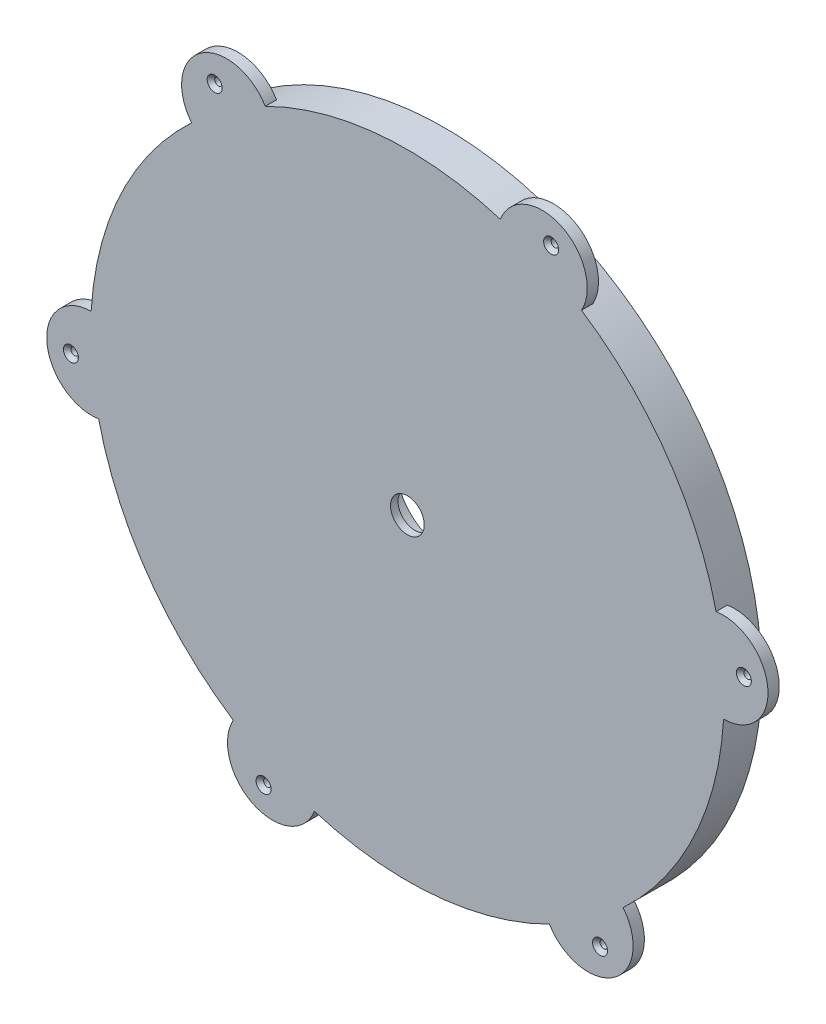
ISO-10303-21;
HEADER;
FILE_DESCRIPTION(('STEP AP214'),'2;1');
FILE_NAME('part.step','',(''),(''),'','','');
FILE_SCHEMA(('AUTOMOTIVE_DESIGN { 1 0 10303 214 1 1 1 1 }'));
ENDSEC;
DATA;
#1=APPLICATION_CONTEXT('core data for automotive mechanical design processes');
#2=APPLICATION_PROTOCOL_DEFINITION('international standard','automotive_design',2000,#1);
#3=PRODUCT_CONTEXT('',#1,'mechanical');
#4=PRODUCT('Part','Part','',(#3));
#5=PRODUCT_RELATED_PRODUCT_CATEGORY('part','',(#4));
#6=PRODUCT_DEFINITION_FORMATION('','',#4);
#7=PRODUCT_DEFINITION_CONTEXT('part definition',#1,'design');
#8=PRODUCT_DEFINITION('design','',#6,#7);
#9=PRODUCT_DEFINITION_SHAPE('','',#8);
#10=(LENGTH_UNIT() NAMED_UNIT(*) SI_UNIT(.MILLI.,.METRE.));
#11=(NAMED_UNIT(*) PLANE_ANGLE_UNIT() SI_UNIT($,.RADIAN.));
#12=(NAMED_UNIT(*) SI_UNIT($,.STERADIAN.) SOLID_ANGLE_UNIT());
#13=UNCERTAINTY_MEASURE_WITH_UNIT(LENGTH_MEASURE(1.E-05),#10,'distance_accuracy_value','');
#14=(GEOMETRIC_REPRESENTATION_CONTEXT(3) GLOBAL_UNCERTAINTY_ASSIGNED_CONTEXT((#13)) GLOBAL_UNIT_ASSIGNED_CONTEXT((#10,
#11,#12)) REPRESENTATION_CONTEXT('',''));
#15=CARTESIAN_POINT('',(0.,0.,0.));
#16=DIRECTION('',(0.,0.,1.));
#17=DIRECTION('',(1.,0.,0.));
#18=AXIS2_PLACEMENT_3D('',#15,#16,#17);
#19=CARTESIAN_POINT('',(0.,0.,10.));
#20=DIRECTION('',(0.,0.,1.));
#21=DIRECTION('',(1.,0.,0.));
#22=AXIS2_PLACEMENT_3D('',#19,#20,#21);
#23=PLANE('',#22);
#24=CARTESIAN_POINT('',(38.3585910993566,81.4980832233902,10.));
#25=DIRECTION('',(0.,0.,1.));
#26=DIRECTION('',(1.,0.,0.));
#27=AXIS2_PLACEMENT_3D('',#24,#25,#26);
#28=CIRCLE('',#27,2.);
#29=CARTESIAN_POINT('',(40.3585910993566,81.4980832233902,10.));
#30=VERTEX_POINT('',#29);
#31=EDGE_CURVE('E305',#30,#30,#28,.T.);
#32=ORIENTED_EDGE('',*,*,#31,.F.);
#33=EDGE_LOOP('',(#32));
#34=FACE_BOUND('',#33,.T.);
#35=CARTESIAN_POINT('',(-51.4001148815162,73.9685559571175,10.));
#36=DIRECTION('',(0.,0.,1.));
#37=DIRECTION('',(1.,0.,0.));
#38=AXIS2_PLACEMENT_3D('',#35,#36,#37);
#39=CIRCLE('',#38,2.);
#40=CARTESIAN_POINT('',(-49.4001148815162,73.9685559571175,10.));
#41=VERTEX_POINT('',#40);
#42=EDGE_CURVE('E226',#41,#41,#39,.T.);
#43=ORIENTED_EDGE('',*,*,#42,.F.);
#44=EDGE_LOOP('',(#43));
#45=FACE_BOUND('',#44,.T.);
#46=CARTESIAN_POINT('',(-89.7587059808725,-7.52952726627367,10.));
#47=DIRECTION('',(0.,0.,1.));
#48=DIRECTION('',(1.,0.,0.));
#49=AXIS2_PLACEMENT_3D('',#46,#47,#48);
#50=CIRCLE('',#49,2.);
#51=CARTESIAN_POINT('',(-87.7587059808725,-7.52952726627367,10.));
#52=VERTEX_POINT('',#51);
#53=EDGE_CURVE('E219',#52,#52,#50,.T.);
#54=ORIENTED_EDGE('',*,*,#53,.F.);
#55=EDGE_LOOP('',(#54));
#56=FACE_BOUND('',#55,.T.);
#57=CARTESIAN_POINT('',(-38.3585910993561,-81.4980832233905,10.));
#58=DIRECTION('',(0.,0.,1.));
#59=DIRECTION('',(1.,0.,0.));
#60=AXIS2_PLACEMENT_3D('',#57,#58,#59);
#61=CIRCLE('',#60,2.);
#62=CARTESIAN_POINT('',(-36.3585910993561,-81.4980832233905,10.));
#63=VERTEX_POINT('',#62);
#64=EDGE_CURVE('E215',#63,#63,#61,.T.);
#65=ORIENTED_EDGE('',*,*,#64,.F.);
#66=EDGE_LOOP('',(#65));
#67=FACE_BOUND('',#66,.T.);
#68=CARTESIAN_POINT('',(51.4001148815167,-73.9685559571171,10.));
#69=DIRECTION('',(0.,0.,1.));
#70=DIRECTION('',(1.,0.,0.));
#71=AXIS2_PLACEMENT_3D('',#68,#69,#70);
#72=CIRCLE('',#71,2.);
#73=CARTESIAN_POINT('',(53.4001148815167,-73.9685559571171,10.));
#74=VERTEX_POINT('',#73);
#75=EDGE_CURVE('E211',#74,#74,#72,.T.);
#76=ORIENTED_EDGE('',*,*,#75,.F.);
#77=EDGE_LOOP('',(#76));
#78=FACE_BOUND('',#77,.T.);
#79=CARTESIAN_POINT('',(89.7587059808725,7.52952726627367,10.));
#80=DIRECTION('',(0.,0.,1.));
#81=DIRECTION('',(1.,0.,0.));
#82=AXIS2_PLACEMENT_3D('',#79,#80,#81);
#83=CIRCLE('',#82,2.);
#84=CARTESIAN_POINT('',(91.7587059808725,7.52952726627367,10.));
#85=VERTEX_POINT('',#84);
#86=EDGE_CURVE('E206',#85,#85,#83,.T.);
#87=ORIENTED_EDGE('',*,*,#86,.F.);
#88=EDGE_LOOP('',(#87));
#89=FACE_BOUND('',#88,.T.);
#90=CARTESIAN_POINT('',(0.,0.,10.));
#91=DIRECTION('',(0.,0.,1.));
#92=DIRECTION('',(1.,0.,0.));
#93=AXIS2_PLACEMENT_3D('',#90,#91,#92);
#94=CIRCLE('',#93,84.5);
#95=CARTESIAN_POINT('',(82.3545809556168,18.9201743021773,10.));
#96=VERTEX_POINT('',#95);
#97=CARTESIAN_POINT('',(46.4521042160023,70.5864860572168,10.));
#98=VERTEX_POINT('',#97);
#99=EDGE_CURVE('E134',#96,#98,#94,.T.);
#100=ORIENTED_EDGE('',*,*,#99,.T.);
#101=CARTESIAN_POINT('',(35.9848816025201,76.4548121183527,10.));
#102=DIRECTION('',(0.,0.,1.));
#103=DIRECTION('',(0.50000000000001,0.866025403784433,0.));
#104=AXIS2_PLACEMENT_3D('',#101,#102,#103);
#105=CIRCLE('',#104,12.);
#106=CARTESIAN_POINT('',(24.7919388880943,80.7812463766746,10.));
#107=VERTEX_POINT('',#106);
#108=EDGE_CURVE('E50',#98,#107,#105,.T.);
#109=ORIENTED_EDGE('',*,*,#108,.T.);
#110=CARTESIAN_POINT('',(-37.9036379814249,75.5219453389085,10.));
#111=VERTEX_POINT('',#110);
#112=EDGE_CURVE('E141',#107,#111,#94,.T.);
#113=ORIENTED_EDGE('',*,*,#112,.T.);
#114=CARTESIAN_POINT('',(-48.2193687347999,69.3912276791339,10.));
#115=DIRECTION('',(0.,0.,1.));
#116=DIRECTION('',(-0.499999999999992,0.866025403784443,0.));
#117=AXIS2_PLACEMENT_3D('',#114,#115,#116);
#118=CIRCLE('',#117,12.);
#119=CARTESIAN_POINT('',(-57.5626420675229,61.8610720744981,10.));
#120=VERTEX_POINT('',#119);
#121=EDGE_CURVE('E56',#111,#120,#118,.T.);
#122=ORIENTED_EDGE('',*,*,#121,.T.);
#123=CARTESIAN_POINT('',(-84.3557421974271,4.93545928169082,10.));
#124=VERTEX_POINT('',#123);
#125=EDGE_CURVE('E146',#120,#124,#94,.T.);
#126=ORIENTED_EDGE('',*,*,#125,.T.);
#127=CARTESIAN_POINT('',(-84.2042503373198,-7.06358443921965,10.));
#128=DIRECTION('',(0.,0.,1.));
#129=DIRECTION('',(-1.,0.,0.));
#130=AXIS2_PLACEMENT_3D('',#127,#128,#129);
#131=CIRCLE('',#130,12.);
#132=CARTESIAN_POINT('',(-82.3545809556168,-18.9201743021773,10.));
#133=VERTEX_POINT('',#132);
#134=EDGE_CURVE('E252',#124,#133,#131,.T.);
#135=ORIENTED_EDGE('',*,*,#134,.T.);
#136=CARTESIAN_POINT('',(-46.4521042160018,-70.5864860572171,10.));
#137=VERTEX_POINT('',#136);
#138=EDGE_CURVE('E152',#133,#137,#94,.T.);
#139=ORIENTED_EDGE('',*,*,#138,.T.);
#140=CARTESIAN_POINT('',(-35.9848816025196,-76.454812118353,10.));
#141=DIRECTION('',(0.,0.,1.));
#142=DIRECTION('',(-0.500000000000004,-0.866025403784436,0.));
#143=AXIS2_PLACEMENT_3D('',#140,#141,#142);
#144=CIRCLE('',#143,12.);
#145=CARTESIAN_POINT('',(-24.7919388880937,-80.7812463766748,10.));
#146=VERTEX_POINT('',#145);
#147=EDGE_CURVE('E257',#137,#146,#144,.T.);
#148=ORIENTED_EDGE('',*,*,#147,.T.);
#149=CARTESIAN_POINT('',(37.9036379814254,-75.5219453389083,10.));
#150=VERTEX_POINT('',#149);
#151=EDGE_CURVE('E149',#146,#150,#94,.T.);
#152=ORIENTED_EDGE('',*,*,#151,.T.);
#153=CARTESIAN_POINT('',(48.2193687348004,-69.3912276791336,10.));
#154=DIRECTION('',(0.,0.,1.));
#155=DIRECTION('',(0.499999999999998,-0.86602540378444,0.));
#156=AXIS2_PLACEMENT_3D('',#153,#154,#155);
#157=CIRCLE('',#156,12.);
#158=CARTESIAN_POINT('',(57.5626420675233,-61.8610720744977,10.));
#159=VERTEX_POINT('',#158);
#160=EDGE_CURVE('E262',#150,#159,#157,.T.);
#161=ORIENTED_EDGE('',*,*,#160,.T.);
#162=CARTESIAN_POINT('',(84.3557421974271,-4.93545928169082,10.));
#163=VERTEX_POINT('',#162);
#164=EDGE_CURVE('E143',#159,#163,#94,.T.);
#165=ORIENTED_EDGE('',*,*,#164,.T.);
#166=CARTESIAN_POINT('',(84.2042503373198,7.06358443921965,10.));
#167=DIRECTION('',(0.,0.,1.));
#168=DIRECTION('',(1.,0.,0.));
#169=AXIS2_PLACEMENT_3D('',#166,#167,#168);
#170=CIRCLE('',#169,12.);
#171=EDGE_CURVE('E138',#163,#96,#170,.T.);
#172=ORIENTED_EDGE('',*,*,#171,.T.);
#173=EDGE_LOOP('',(#100,#109,#113,#122,#126,#135,#139,#148,#152,#161,#165,#172));
#174=FACE_BOUND('',#173,.T.);
#175=CARTESIAN_POINT('',(0.,0.,10.));
#176=DIRECTION('',(0.,0.,1.));
#177=DIRECTION('',(1.,0.,0.));
#178=AXIS2_PLACEMENT_3D('',#175,#176,#177);
#179=CIRCLE('',#178,4.5);
#180=CARTESIAN_POINT('',(4.5,0.,10.));
#181=VERTEX_POINT('',#180);
#182=EDGE_CURVE('E154',#181,#181,#179,.T.);
#183=ORIENTED_EDGE('',*,*,#182,.F.);
#184=EDGE_LOOP('',(#183));
#185=FACE_BOUND('',#184,.T.);
#186=ADVANCED_FACE('F33',(#34,#45,#56,#67,#78,#89,#174,#185),#23,.T.);
#187=CARTESIAN_POINT('',(0.,0.,0.));
#188=DIRECTION('',(0.,0.,1.));
#189=DIRECTION('',(1.,0.,0.));
#190=AXIS2_PLACEMENT_3D('',#187,#188,#189);
#191=PLANE('',#190);
#192=CARTESIAN_POINT('',(0.,0.,0.));
#193=DIRECTION('',(0.,0.,1.));
#194=DIRECTION('',(1.,0.,0.));
#195=AXIS2_PLACEMENT_3D('',#192,#193,#194);
#196=CIRCLE('',#195,13.);
#197=CARTESIAN_POINT('',(13.,0.,0.));
#198=VERTEX_POINT('',#197);
#199=EDGE_CURVE('E271',#198,#198,#196,.T.);
#200=ORIENTED_EDGE('',*,*,#199,.T.);
#201=EDGE_LOOP('',(#200));
#202=FACE_BOUND('',#201,.T.);
#203=CARTESIAN_POINT('',(0.,0.,0.));
#204=DIRECTION('',(0.,0.,1.));
#205=DIRECTION('',(1.,0.,0.));
#206=AXIS2_PLACEMENT_3D('',#203,#204,#205);
#207=CIRCLE('',#206,84.5);
#208=CARTESIAN_POINT('',(84.5,0.,0.));
#209=VERTEX_POINT('',#208);
#210=EDGE_CURVE('E150',#209,#209,#207,.T.);
#211=ORIENTED_EDGE('',*,*,#210,.F.);
#212=EDGE_LOOP('',(#211));
#213=FACE_BOUND('',#212,.T.);
#214=ADVANCED_FACE('F278',(#202,#213),#191,.F.);
#215=CARTESIAN_POINT('',(0.,0.,10.));
#216=DIRECTION('',(0.,0.,-1.));
#217=DIRECTION('',(-1.,0.,0.));
#218=AXIS2_PLACEMENT_3D('',#215,#216,#217);
#219=CYLINDRICAL_SURFACE('',#218,84.5);
#220=CARTESIAN_POINT('',(0.,0.,7.));
#221=DIRECTION('',(0.,0.,1.));
#222=DIRECTION('',(1.,0.,0.));
#223=AXIS2_PLACEMENT_3D('',#220,#221,#222);
#224=CIRCLE('',#223,84.5);
#225=CARTESIAN_POINT('',(46.4521042160023,70.5864860572168,7.));
#226=VERTEX_POINT('',#225);
#227=CARTESIAN_POINT('',(24.7919388880943,80.7812463766746,7.));
#228=VERTEX_POINT('',#227);
#229=EDGE_CURVE('E135',#226,#228,#224,.T.);
#230=ORIENTED_EDGE('',*,*,#229,.F.);
#231=DIRECTION('',(0.,0.,1.));
#232=VECTOR('',#231,1.);
#233=CARTESIAN_POINT('',(46.4521042160023,70.5864860572168,8.5));
#234=LINE('',#233,#232);
#235=EDGE_CURVE('E11',#226,#98,#234,.T.);
#236=ORIENTED_EDGE('',*,*,#235,.T.);
#237=ORIENTED_EDGE('',*,*,#99,.F.);
#238=DIRECTION('',(0.,0.,1.));
#239=VECTOR('',#238,1.);
#240=CARTESIAN_POINT('',(82.3545809556167,18.9201743021773,8.5));
#241=LINE('',#240,#239);
#242=CARTESIAN_POINT('',(82.3545809556168,18.9201743021773,7.));
#243=VERTEX_POINT('',#242);
#244=EDGE_CURVE('E144',#96,#243,#241,.F.);
#245=ORIENTED_EDGE('',*,*,#244,.T.);
#246=CARTESIAN_POINT('',(0.,0.,7.));
#247=DIRECTION('',(0.,0.,1.));
#248=DIRECTION('',(1.,0.,0.));
#249=AXIS2_PLACEMENT_3D('',#246,#247,#248);
#250=CIRCLE('',#249,84.5);
#251=CARTESIAN_POINT('',(84.3557421974271,-4.93545928169082,7.));
#252=VERTEX_POINT('',#251);
#253=EDGE_CURVE('E140',#252,#243,#250,.T.);
#254=ORIENTED_EDGE('',*,*,#253,.F.);
#255=DIRECTION('',(0.,0.,1.));
#256=VECTOR('',#255,1.);
#257=CARTESIAN_POINT('',(84.3557421974271,-4.93545928169082,8.5));
#258=LINE('',#257,#256);
#259=EDGE_CURVE('E163',#252,#163,#258,.T.);
#260=ORIENTED_EDGE('',*,*,#259,.T.);
#261=ORIENTED_EDGE('',*,*,#164,.F.);
#262=DIRECTION('',(0.,0.,1.));
#263=VECTOR('',#262,1.);
#264=CARTESIAN_POINT('',(57.5626420675233,-61.8610720744977,8.5));
#265=LINE('',#264,#263);
#266=CARTESIAN_POINT('',(57.5626420675233,-61.8610720744977,7.));
#267=VERTEX_POINT('',#266);
#268=EDGE_CURVE('E168',#159,#267,#265,.F.);
#269=ORIENTED_EDGE('',*,*,#268,.T.);
#270=CARTESIAN_POINT('',(0.,0.,7.));
#271=DIRECTION('',(0.,0.,1.));
#272=DIRECTION('',(1.,0.,0.));
#273=AXIS2_PLACEMENT_3D('',#270,#271,#272);
#274=CIRCLE('',#273,84.5);
#275=CARTESIAN_POINT('',(37.9036379814254,-75.5219453389083,7.));
#276=VERTEX_POINT('',#275);
#277=EDGE_CURVE('E166',#276,#267,#274,.T.);
#278=ORIENTED_EDGE('',*,*,#277,.F.);
#279=DIRECTION('',(0.,0.,1.));
#280=VECTOR('',#279,1.);
#281=CARTESIAN_POINT('',(37.9036379814254,-75.5219453389083,8.5));
#282=LINE('',#281,#280);
#283=EDGE_CURVE('E171',#276,#150,#282,.T.);
#284=ORIENTED_EDGE('',*,*,#283,.T.);
#285=ORIENTED_EDGE('',*,*,#151,.F.);
#286=DIRECTION('',(0.,0.,1.));
#287=VECTOR('',#286,1.);
#288=CARTESIAN_POINT('',(-24.7919388880937,-80.7812463766748,8.5));
#289=LINE('',#288,#287);
#290=CARTESIAN_POINT('',(-24.7919388880937,-80.7812463766748,7.));
#291=VERTEX_POINT('',#290);
#292=EDGE_CURVE('E176',#146,#291,#289,.F.);
#293=ORIENTED_EDGE('',*,*,#292,.T.);
#294=CARTESIAN_POINT('',(0.,0.,7.));
#295=DIRECTION('',(0.,0.,1.));
#296=DIRECTION('',(1.,0.,0.));
#297=AXIS2_PLACEMENT_3D('',#294,#295,#296);
#298=CIRCLE('',#297,84.5);
#299=CARTESIAN_POINT('',(-46.4521042160018,-70.5864860572171,7.));
#300=VERTEX_POINT('',#299);
#301=EDGE_CURVE('E174',#300,#291,#298,.T.);
#302=ORIENTED_EDGE('',*,*,#301,.F.);
#303=DIRECTION('',(0.,0.,1.));
#304=VECTOR('',#303,1.);
#305=CARTESIAN_POINT('',(-46.4521042160018,-70.5864860572171,8.5));
#306=LINE('',#305,#304);
#307=EDGE_CURVE('E179',#300,#137,#306,.T.);
#308=ORIENTED_EDGE('',*,*,#307,.T.);
#309=ORIENTED_EDGE('',*,*,#138,.F.);
#310=DIRECTION('',(0.,0.,1.));
#311=VECTOR('',#310,1.);
#312=CARTESIAN_POINT('',(-82.3545809556167,-18.9201743021773,8.5));
#313=LINE('',#312,#311);
#314=CARTESIAN_POINT('',(-82.3545809556168,-18.9201743021773,7.));
#315=VERTEX_POINT('',#314);
#316=EDGE_CURVE('E184',#133,#315,#313,.F.);
#317=ORIENTED_EDGE('',*,*,#316,.T.);
#318=CARTESIAN_POINT('',(0.,0.,7.));
#319=DIRECTION('',(0.,0.,1.));
#320=DIRECTION('',(1.,0.,0.));
#321=AXIS2_PLACEMENT_3D('',#318,#319,#320);
#322=CIRCLE('',#321,84.5);
#323=CARTESIAN_POINT('',(-84.3557421974271,4.93545928169082,7.));
#324=VERTEX_POINT('',#323);
#325=EDGE_CURVE('E182',#324,#315,#322,.T.);
#326=ORIENTED_EDGE('',*,*,#325,.F.);
#327=DIRECTION('',(0.,0.,1.));
#328=VECTOR('',#327,1.);
#329=CARTESIAN_POINT('',(-84.3557421974271,4.93545928169082,8.5));
#330=LINE('',#329,#328);
#331=EDGE_CURVE('E187',#324,#124,#330,.T.);
#332=ORIENTED_EDGE('',*,*,#331,.T.);
#333=ORIENTED_EDGE('',*,*,#125,.F.);
#334=DIRECTION('',(0.,0.,1.));
#335=VECTOR('',#334,1.);
#336=CARTESIAN_POINT('',(-57.5626420675228,61.8610720744981,8.5));
#337=LINE('',#336,#335);
#338=CARTESIAN_POINT('',(-57.5626420675229,61.8610720744981,7.));
#339=VERTEX_POINT('',#338);
#340=EDGE_CURVE('E192',#120,#339,#337,.F.);
#341=ORIENTED_EDGE('',*,*,#340,.T.);
#342=CARTESIAN_POINT('',(0.,0.,7.));
#343=DIRECTION('',(0.,0.,1.));
#344=DIRECTION('',(1.,0.,0.));
#345=AXIS2_PLACEMENT_3D('',#342,#343,#344);
#346=CIRCLE('',#345,84.5);
#347=CARTESIAN_POINT('',(-37.9036379814249,75.5219453389085,7.));
#348=VERTEX_POINT('',#347);
#349=EDGE_CURVE('E190',#348,#339,#346,.T.);
#350=ORIENTED_EDGE('',*,*,#349,.F.);
#351=DIRECTION('',(0.,0.,1.));
#352=VECTOR('',#351,1.);
#353=CARTESIAN_POINT('',(-37.9036379814249,75.5219453389085,8.5));
#354=LINE('',#353,#352);
#355=EDGE_CURVE('E195',#348,#111,#354,.T.);
#356=ORIENTED_EDGE('',*,*,#355,.T.);
#357=ORIENTED_EDGE('',*,*,#112,.F.);
#358=DIRECTION('',(0.,0.,1.));
#359=VECTOR('',#358,1.);
#360=CARTESIAN_POINT('',(24.7919388880943,80.7812463766746,8.5));
#361=LINE('',#360,#359);
#362=EDGE_CURVE('E42',#107,#228,#361,.F.);
#363=ORIENTED_EDGE('',*,*,#362,.T.);
#364=EDGE_LOOP('',(#230,#236,#237,#245,#254,#260,#261,#269,#278,#284,#285,#293,#302,#308,#309,
#317,#326,#332,#333,#341,#350,#356,#357,#363));
#365=FACE_BOUND('',#364,.T.);
#366=ORIENTED_EDGE('',*,*,#210,.T.);
#367=EDGE_LOOP('',(#366));
#368=FACE_BOUND('',#367,.T.);
#369=ADVANCED_FACE('F35',(#365,#368),#219,.T.);
#370=CARTESIAN_POINT('',(0.,0.,10.));
#371=DIRECTION('',(0.,0.,-1.));
#372=DIRECTION('',(-1.,0.,0.));
#373=AXIS2_PLACEMENT_3D('',#370,#371,#372);
#374=CYLINDRICAL_SURFACE('',#373,4.5);
#375=CARTESIAN_POINT('',(0.,0.,8.));
#376=DIRECTION('',(0.,0.,1.));
#377=DIRECTION('',(1.,0.,0.));
#378=AXIS2_PLACEMENT_3D('',#375,#376,#377);
#379=CIRCLE('',#378,4.5);
#380=CARTESIAN_POINT('',(4.5,0.,8.));
#381=VERTEX_POINT('',#380);
#382=EDGE_CURVE('E157',#381,#381,#379,.T.);
#383=ORIENTED_EDGE('',*,*,#382,.F.);
#384=EDGE_LOOP('',(#383));
#385=FACE_BOUND('',#384,.T.);
#386=ORIENTED_EDGE('',*,*,#182,.T.);
#387=EDGE_LOOP('',(#386));
#388=FACE_BOUND('',#387,.T.);
#389=ADVANCED_FACE('F284',(#385,#388),#374,.F.);
#390=CARTESIAN_POINT('',(0.,0.,8.));
#391=DIRECTION('',(0.,0.,-1.));
#392=DIRECTION('',(-1.,0.,0.));
#393=AXIS2_PLACEMENT_3D('',#390,#391,#392);
#394=CYLINDRICAL_SURFACE('',#393,13.);
#395=CARTESIAN_POINT('',(0.,0.,8.));
#396=DIRECTION('',(0.,0.,1.));
#397=DIRECTION('',(1.,0.,0.));
#398=AXIS2_PLACEMENT_3D('',#395,#396,#397);
#399=CIRCLE('',#398,13.);
#400=CARTESIAN_POINT('',(13.,0.,8.));
#401=VERTEX_POINT('',#400);
#402=EDGE_CURVE('E160',#401,#401,#399,.T.);
#403=ORIENTED_EDGE('',*,*,#402,.T.);
#404=EDGE_LOOP('',(#403));
#405=FACE_BOUND('',#404,.T.);
#406=ORIENTED_EDGE('',*,*,#199,.F.);
#407=EDGE_LOOP('',(#406));
#408=FACE_BOUND('',#407,.T.);
#409=ADVANCED_FACE('F281',(#405,#408),#394,.F.);
#410=CARTESIAN_POINT('',(0.,0.,8.));
#411=DIRECTION('',(0.,0.,1.));
#412=DIRECTION('',(1.,0.,0.));
#413=AXIS2_PLACEMENT_3D('',#410,#411,#412);
#414=PLANE('',#413);
#415=ORIENTED_EDGE('',*,*,#382,.T.);
#416=EDGE_LOOP('',(#415));
#417=FACE_BOUND('',#416,.T.);
#418=ORIENTED_EDGE('',*,*,#402,.F.);
#419=EDGE_LOOP('',(#418));
#420=FACE_BOUND('',#419,.T.);
#421=ADVANCED_FACE('F283',(#417,#420),#414,.F.);
#422=CARTESIAN_POINT('',(84.2042503373198,7.06358443921965,7.));
#423=DIRECTION('',(0.,0.,1.));
#424=DIRECTION('',(1.,0.,0.));
#425=AXIS2_PLACEMENT_3D('',#422,#423,#424);
#426=CYLINDRICAL_SURFACE('',#425,12.);
#427=ORIENTED_EDGE('',*,*,#259,.F.);
#428=CARTESIAN_POINT('',(84.2042503373198,7.06358443921965,7.));
#429=DIRECTION('',(0.,0.,1.));
#430=DIRECTION('',(1.,0.,0.));
#431=AXIS2_PLACEMENT_3D('',#428,#429,#430);
#432=CIRCLE('',#431,12.);
#433=EDGE_CURVE('E268',#252,#243,#432,.T.);
#434=ORIENTED_EDGE('',*,*,#433,.T.);
#435=ORIENTED_EDGE('',*,*,#244,.F.);
#436=ORIENTED_EDGE('',*,*,#171,.F.);
#437=EDGE_LOOP('',(#427,#434,#435,#436));
#438=FACE_BOUND('',#437,.T.);
#439=ADVANCED_FACE('F291',(#438),#426,.T.);
#440=CARTESIAN_POINT('',(84.2042503373198,7.06358443921965,7.));
#441=DIRECTION('',(0.,0.,1.));
#442=DIRECTION('',(1.,0.,0.));
#443=AXIS2_PLACEMENT_3D('',#440,#441,#442);
#444=PLANE('',#443);
#445=CARTESIAN_POINT('',(89.7587059808725,7.52952726627367,7.));
#446=DIRECTION('',(0.,0.,1.));
#447=DIRECTION('',(1.,0.,0.));
#448=AXIS2_PLACEMENT_3D('',#445,#446,#447);
#449=CIRCLE('',#448,1.);
#450=CARTESIAN_POINT('',(90.7587059808725,7.52952726627367,7.));
#451=VERTEX_POINT('',#450);
#452=EDGE_CURVE('E127',#451,#451,#449,.T.);
#453=ORIENTED_EDGE('',*,*,#452,.T.);
#454=EDGE_LOOP('',(#453));
#455=FACE_BOUND('',#454,.T.);
#456=ORIENTED_EDGE('',*,*,#433,.F.);
#457=ORIENTED_EDGE('',*,*,#253,.T.);
#458=EDGE_LOOP('',(#456,#457));
#459=FACE_BOUND('',#458,.T.);
#460=ADVANCED_FACE('F370',(#455,#459),#444,.F.);
#461=CARTESIAN_POINT('',(48.2193687348004,-69.3912276791336,7.));
#462=DIRECTION('',(0.,0.,1.));
#463=DIRECTION('',(1.,0.,0.));
#464=AXIS2_PLACEMENT_3D('',#461,#462,#463);
#465=CYLINDRICAL_SURFACE('',#464,12.);
#466=ORIENTED_EDGE('',*,*,#283,.F.);
#467=CARTESIAN_POINT('',(48.2193687348004,-69.3912276791336,7.));
#468=DIRECTION('',(0.,0.,1.));
#469=DIRECTION('',(0.499999999999998,-0.86602540378444,0.));
#470=AXIS2_PLACEMENT_3D('',#467,#468,#469);
#471=CIRCLE('',#470,12.);
#472=EDGE_CURVE('E264',#276,#267,#471,.T.);
#473=ORIENTED_EDGE('',*,*,#472,.T.);
#474=ORIENTED_EDGE('',*,*,#268,.F.);
#475=ORIENTED_EDGE('',*,*,#160,.F.);
#476=EDGE_LOOP('',(#466,#473,#474,#475));
#477=FACE_BOUND('',#476,.T.);
#478=ADVANCED_FACE('F366',(#477),#465,.T.);
#479=CARTESIAN_POINT('',(48.2193687348004,-69.3912276791336,7.));
#480=DIRECTION('',(0.,0.,1.));
#481=DIRECTION('',(0.499999999999998,-0.86602540378444,0.));
#482=AXIS2_PLACEMENT_3D('',#479,#480,#481);
#483=PLANE('',#482);
#484=CARTESIAN_POINT('',(51.4001148815167,-73.9685559571171,7.));
#485=DIRECTION('',(0.,0.,1.));
#486=DIRECTION('',(1.,0.,0.));
#487=AXIS2_PLACEMENT_3D('',#484,#485,#486);
#488=CIRCLE('',#487,0.999999999999997);
#489=CARTESIAN_POINT('',(52.4001148815167,-73.9685559571171,7.));
#490=VERTEX_POINT('',#489);
#491=EDGE_CURVE('E203',#490,#490,#488,.T.);
#492=ORIENTED_EDGE('',*,*,#491,.T.);
#493=EDGE_LOOP('',(#492));
#494=FACE_BOUND('',#493,.T.);
#495=ORIENTED_EDGE('',*,*,#472,.F.);
#496=ORIENTED_EDGE('',*,*,#277,.T.);
#497=EDGE_LOOP('',(#495,#496));
#498=FACE_BOUND('',#497,.T.);
#499=ADVANCED_FACE('F362',(#494,#498),#483,.F.);
#500=CARTESIAN_POINT('',(-35.9848816025196,-76.454812118353,7.));
#501=DIRECTION('',(0.,0.,1.));
#502=DIRECTION('',(1.,0.,0.));
#503=AXIS2_PLACEMENT_3D('',#500,#501,#502);
#504=CYLINDRICAL_SURFACE('',#503,12.);
#505=ORIENTED_EDGE('',*,*,#307,.F.);
#506=CARTESIAN_POINT('',(-35.9848816025196,-76.454812118353,7.));
#507=DIRECTION('',(0.,0.,1.));
#508=DIRECTION('',(-0.500000000000004,-0.866025403784436,0.));
#509=AXIS2_PLACEMENT_3D('',#506,#507,#508);
#510=CIRCLE('',#509,12.);
#511=EDGE_CURVE('E259',#300,#291,#510,.T.);
#512=ORIENTED_EDGE('',*,*,#511,.T.);
#513=ORIENTED_EDGE('',*,*,#292,.F.);
#514=ORIENTED_EDGE('',*,*,#147,.F.);
#515=EDGE_LOOP('',(#505,#512,#513,#514));
#516=FACE_BOUND('',#515,.T.);
#517=ADVANCED_FACE('F358',(#516),#504,.T.);
#518=CARTESIAN_POINT('',(-35.9848816025196,-76.454812118353,7.));
#519=DIRECTION('',(0.,0.,1.));
#520=DIRECTION('',(-0.500000000000004,-0.866025403784436,0.));
#521=AXIS2_PLACEMENT_3D('',#518,#519,#520);
#522=PLANE('',#521);
#523=CARTESIAN_POINT('',(-38.3585910993561,-81.4980832233905,7.));
#524=DIRECTION('',(0.,0.,1.));
#525=DIRECTION('',(1.,0.,0.));
#526=AXIS2_PLACEMENT_3D('',#523,#524,#525);
#527=CIRCLE('',#526,1.);
#528=CARTESIAN_POINT('',(-37.3585910993561,-81.4980832233905,7.));
#529=VERTEX_POINT('',#528);
#530=EDGE_CURVE('E208',#529,#529,#527,.T.);
#531=ORIENTED_EDGE('',*,*,#530,.T.);
#532=EDGE_LOOP('',(#531));
#533=FACE_BOUND('',#532,.T.);
#534=ORIENTED_EDGE('',*,*,#511,.F.);
#535=ORIENTED_EDGE('',*,*,#301,.T.);
#536=EDGE_LOOP('',(#534,#535));
#537=FACE_BOUND('',#536,.T.);
#538=ADVANCED_FACE('F354',(#533,#537),#522,.F.);
#539=CARTESIAN_POINT('',(-84.2042503373198,-7.06358443921965,7.));
#540=DIRECTION('',(0.,0.,1.));
#541=DIRECTION('',(1.,0.,0.));
#542=AXIS2_PLACEMENT_3D('',#539,#540,#541);
#543=CYLINDRICAL_SURFACE('',#542,12.);
#544=ORIENTED_EDGE('',*,*,#331,.F.);
#545=CARTESIAN_POINT('',(-84.2042503373198,-7.06358443921965,7.));
#546=DIRECTION('',(0.,0.,1.));
#547=DIRECTION('',(-1.,0.,0.));
#548=AXIS2_PLACEMENT_3D('',#545,#546,#547);
#549=CIRCLE('',#548,12.);
#550=EDGE_CURVE('E254',#324,#315,#549,.T.);
#551=ORIENTED_EDGE('',*,*,#550,.T.);
#552=ORIENTED_EDGE('',*,*,#316,.F.);
#553=ORIENTED_EDGE('',*,*,#134,.F.);
#554=EDGE_LOOP('',(#544,#551,#552,#553));
#555=FACE_BOUND('',#554,.T.);
#556=ADVANCED_FACE('F350',(#555),#543,.T.);
#557=CARTESIAN_POINT('',(-84.2042503373198,-7.06358443921965,7.));
#558=DIRECTION('',(0.,0.,1.));
#559=DIRECTION('',(-1.,0.,0.));
#560=AXIS2_PLACEMENT_3D('',#557,#558,#559);
#561=PLANE('',#560);
#562=CARTESIAN_POINT('',(-89.7587059808725,-7.52952726627367,7.));
#563=DIRECTION('',(0.,0.,1.));
#564=DIRECTION('',(1.,0.,0.));
#565=AXIS2_PLACEMENT_3D('',#562,#563,#564);
#566=CIRCLE('',#565,1.);
#567=CARTESIAN_POINT('',(-88.7587059808725,-7.52952726627367,7.));
#568=VERTEX_POINT('',#567);
#569=EDGE_CURVE('E213',#568,#568,#566,.T.);
#570=ORIENTED_EDGE('',*,*,#569,.T.);
#571=EDGE_LOOP('',(#570));
#572=FACE_BOUND('',#571,.T.);
#573=ORIENTED_EDGE('',*,*,#550,.F.);
#574=ORIENTED_EDGE('',*,*,#325,.T.);
#575=EDGE_LOOP('',(#573,#574));
#576=FACE_BOUND('',#575,.T.);
#577=ADVANCED_FACE('F346',(#572,#576),#561,.F.);
#578=CARTESIAN_POINT('',(-48.2193687347999,69.3912276791339,7.));
#579=DIRECTION('',(0.,0.,1.));
#580=DIRECTION('',(1.,0.,0.));
#581=AXIS2_PLACEMENT_3D('',#578,#579,#580);
#582=CYLINDRICAL_SURFACE('',#581,12.);
#583=ORIENTED_EDGE('',*,*,#355,.F.);
#584=CARTESIAN_POINT('',(-48.2193687347999,69.3912276791339,7.));
#585=DIRECTION('',(0.,0.,1.));
#586=DIRECTION('',(-0.499999999999992,0.866025403784443,0.));
#587=AXIS2_PLACEMENT_3D('',#584,#585,#586);
#588=CIRCLE('',#587,12.);
#589=EDGE_CURVE('E249',#348,#339,#588,.T.);
#590=ORIENTED_EDGE('',*,*,#589,.T.);
#591=ORIENTED_EDGE('',*,*,#340,.F.);
#592=ORIENTED_EDGE('',*,*,#121,.F.);
#593=EDGE_LOOP('',(#583,#590,#591,#592));
#594=FACE_BOUND('',#593,.T.);
#595=ADVANCED_FACE('F343',(#594),#582,.T.);
#596=CARTESIAN_POINT('',(-48.2193687347999,69.3912276791339,7.));
#597=DIRECTION('',(0.,0.,1.));
#598=DIRECTION('',(-0.499999999999992,0.866025403784443,0.));
#599=AXIS2_PLACEMENT_3D('',#596,#597,#598);
#600=PLANE('',#599);
#601=CARTESIAN_POINT('',(-51.4001148815162,73.9685559571175,7.));
#602=DIRECTION('',(0.,0.,1.));
#603=DIRECTION('',(1.,0.,0.));
#604=AXIS2_PLACEMENT_3D('',#601,#602,#603);
#605=CIRCLE('',#604,1.);
#606=CARTESIAN_POINT('',(-50.4001148815162,73.9685559571175,7.));
#607=VERTEX_POINT('',#606);
#608=EDGE_CURVE('E217',#607,#607,#605,.T.);
#609=ORIENTED_EDGE('',*,*,#608,.T.);
#610=EDGE_LOOP('',(#609));
#611=FACE_BOUND('',#610,.T.);
#612=ORIENTED_EDGE('',*,*,#589,.F.);
#613=ORIENTED_EDGE('',*,*,#349,.T.);
#614=EDGE_LOOP('',(#612,#613));
#615=FACE_BOUND('',#614,.T.);
#616=ADVANCED_FACE('F340',(#611,#615),#600,.F.);
#617=CARTESIAN_POINT('',(35.9848816025201,76.4548121183527,7.));
#618=DIRECTION('',(0.,0.,1.));
#619=DIRECTION('',(1.,0.,0.));
#620=AXIS2_PLACEMENT_3D('',#617,#618,#619);
#621=CYLINDRICAL_SURFACE('',#620,12.);
#622=ORIENTED_EDGE('',*,*,#235,.F.);
#623=CARTESIAN_POINT('',(35.9848816025201,76.4548121183527,7.));
#624=DIRECTION('',(0.,0.,1.));
#625=DIRECTION('',(0.50000000000001,0.866025403784433,0.));
#626=AXIS2_PLACEMENT_3D('',#623,#624,#625);
#627=CIRCLE('',#626,12.);
#628=EDGE_CURVE('E126',#226,#228,#627,.T.);
#629=ORIENTED_EDGE('',*,*,#628,.T.);
#630=ORIENTED_EDGE('',*,*,#362,.F.);
#631=ORIENTED_EDGE('',*,*,#108,.F.);
#632=EDGE_LOOP('',(#622,#629,#630,#631));
#633=FACE_BOUND('',#632,.T.);
#634=ADVANCED_FACE('F121',(#633),#621,.T.);
#635=CARTESIAN_POINT('',(35.9848816025201,76.4548121183527,7.));
#636=DIRECTION('',(0.,0.,1.));
#637=DIRECTION('',(0.50000000000001,0.866025403784433,0.));
#638=AXIS2_PLACEMENT_3D('',#635,#636,#637);
#639=PLANE('',#638);
#640=CARTESIAN_POINT('',(38.3585910993566,81.4980832233902,7.));
#641=DIRECTION('',(0.,0.,1.));
#642=DIRECTION('',(1.,0.,0.));
#643=AXIS2_PLACEMENT_3D('',#640,#641,#642);
#644=CIRCLE('',#643,1.);
#645=CARTESIAN_POINT('',(39.3585910993566,81.4980832233902,7.));
#646=VERTEX_POINT('',#645);
#647=EDGE_CURVE('E37',#646,#646,#644,.T.);
#648=ORIENTED_EDGE('',*,*,#647,.T.);
#649=EDGE_LOOP('',(#648));
#650=FACE_BOUND('',#649,.T.);
#651=ORIENTED_EDGE('',*,*,#628,.F.);
#652=ORIENTED_EDGE('',*,*,#229,.T.);
#653=EDGE_LOOP('',(#651,#652));
#654=FACE_BOUND('',#653,.T.);
#655=ADVANCED_FACE('F329',(#650,#654),#639,.F.);
#656=CARTESIAN_POINT('',(89.7587059808725,7.52952726627367,10.));
#657=DIRECTION('',(0.,0.,1.));
#658=DIRECTION('',(1.,0.,0.));
#659=AXIS2_PLACEMENT_3D('',#656,#657,#658);
#660=CYLINDRICAL_SURFACE('',#659,1.);
#661=CARTESIAN_POINT('',(89.7587059808725,7.52952726627367,9.));
#662=DIRECTION('',(0.,0.,1.));
#663=DIRECTION('',(1.,0.,0.));
#664=AXIS2_PLACEMENT_3D('',#661,#662,#663);
#665=CIRCLE('',#664,1.);
#666=CARTESIAN_POINT('',(90.7587059808725,7.52952726627367,9.));
#667=VERTEX_POINT('',#666);
#668=EDGE_CURVE('E202',#667,#667,#665,.T.);
#669=ORIENTED_EDGE('',*,*,#668,.T.);
#670=EDGE_LOOP('',(#669));
#671=FACE_BOUND('',#670,.T.);
#672=ORIENTED_EDGE('',*,*,#452,.F.);
#673=EDGE_LOOP('',(#672));
#674=FACE_BOUND('',#673,.T.);
#675=ADVANCED_FACE('F319',(#671,#674),#660,.F.);
#676=CARTESIAN_POINT('',(89.7587059808725,7.52952726627367,10.));
#677=DIRECTION('',(0.,0.,1.));
#678=DIRECTION('',(1.,0.,0.));
#679=AXIS2_PLACEMENT_3D('',#676,#677,#678);
#680=CONICAL_SURFACE('',#679,2.,0.785398163397448);
#681=ORIENTED_EDGE('',*,*,#668,.F.);
#682=EDGE_LOOP('',(#681));
#683=FACE_BOUND('',#682,.T.);
#684=ORIENTED_EDGE('',*,*,#86,.T.);
#685=EDGE_LOOP('',(#684));
#686=FACE_BOUND('',#685,.T.);
#687=ADVANCED_FACE('F316',(#683,#686),#680,.F.);
#688=CARTESIAN_POINT('',(51.4001148815167,-73.9685559571171,10.));
#689=DIRECTION('',(0.,0.,1.));
#690=DIRECTION('',(1.,0.,0.));
#691=AXIS2_PLACEMENT_3D('',#688,#689,#690);
#692=CYLINDRICAL_SURFACE('',#691,0.999999999999997);
#693=CARTESIAN_POINT('',(51.4001148815167,-73.9685559571171,9.));
#694=DIRECTION('',(0.,0.,1.));
#695=DIRECTION('',(1.,0.,0.));
#696=AXIS2_PLACEMENT_3D('',#693,#694,#695);
#697=CIRCLE('',#696,1.);
#698=CARTESIAN_POINT('',(52.4001148815167,-73.9685559571171,9.));
#699=VERTEX_POINT('',#698);
#700=EDGE_CURVE('E207',#699,#699,#697,.T.);
#701=ORIENTED_EDGE('',*,*,#700,.T.);
#702=EDGE_LOOP('',(#701));
#703=FACE_BOUND('',#702,.T.);
#704=ORIENTED_EDGE('',*,*,#491,.F.);
#705=EDGE_LOOP('',(#704));
#706=FACE_BOUND('',#705,.T.);
#707=ADVANCED_FACE('F318',(#703,#706),#692,.F.);
#708=CARTESIAN_POINT('',(51.4001148815167,-73.9685559571171,10.));
#709=DIRECTION('',(0.,0.,1.));
#710=DIRECTION('',(1.,0.,0.));
#711=AXIS2_PLACEMENT_3D('',#708,#709,#710);
#712=CONICAL_SURFACE('',#711,2.,0.785398163397448);
#713=ORIENTED_EDGE('',*,*,#700,.F.);
#714=EDGE_LOOP('',(#713));
#715=FACE_BOUND('',#714,.T.);
#716=ORIENTED_EDGE('',*,*,#75,.T.);
#717=EDGE_LOOP('',(#716));
#718=FACE_BOUND('',#717,.T.);
#719=ADVANCED_FACE('F326',(#715,#718),#712,.F.);
#720=CARTESIAN_POINT('',(-38.3585910993561,-81.4980832233905,10.));
#721=DIRECTION('',(0.,0.,1.));
#722=DIRECTION('',(1.,0.,0.));
#723=AXIS2_PLACEMENT_3D('',#720,#721,#722);
#724=CYLINDRICAL_SURFACE('',#723,1.);
#725=CARTESIAN_POINT('',(-38.3585910993561,-81.4980832233905,9.));
#726=DIRECTION('',(0.,0.,1.));
#727=DIRECTION('',(1.,0.,0.));
#728=AXIS2_PLACEMENT_3D('',#725,#726,#727);
#729=CIRCLE('',#728,1.);
#730=CARTESIAN_POINT('',(-37.3585910993561,-81.4980832233905,9.));
#731=VERTEX_POINT('',#730);
#732=EDGE_CURVE('E212',#731,#731,#729,.T.);
#733=ORIENTED_EDGE('',*,*,#732,.T.);
#734=EDGE_LOOP('',(#733));
#735=FACE_BOUND('',#734,.T.);
#736=ORIENTED_EDGE('',*,*,#530,.F.);
#737=EDGE_LOOP('',(#736));
#738=FACE_BOUND('',#737,.T.);
#739=ADVANCED_FACE('F533',(#735,#738),#724,.F.);
#740=CARTESIAN_POINT('',(-38.3585910993561,-81.4980832233905,10.));
#741=DIRECTION('',(0.,0.,1.));
#742=DIRECTION('',(1.,0.,0.));
#743=AXIS2_PLACEMENT_3D('',#740,#741,#742);
#744=CONICAL_SURFACE('',#743,2.,0.785398163397448);
#745=ORIENTED_EDGE('',*,*,#732,.F.);
#746=EDGE_LOOP('',(#745));
#747=FACE_BOUND('',#746,.T.);
#748=ORIENTED_EDGE('',*,*,#64,.T.);
#749=EDGE_LOOP('',(#748));
#750=FACE_BOUND('',#749,.T.);
#751=ADVANCED_FACE('F541',(#747,#750),#744,.F.);
#752=CARTESIAN_POINT('',(-89.7587059808725,-7.52952726627367,10.));
#753=DIRECTION('',(0.,0.,1.));
#754=DIRECTION('',(1.,0.,0.));
#755=AXIS2_PLACEMENT_3D('',#752,#753,#754);
#756=CYLINDRICAL_SURFACE('',#755,1.);
#757=CARTESIAN_POINT('',(-89.7587059808725,-7.52952726627367,9.));
#758=DIRECTION('',(0.,0.,1.));
#759=DIRECTION('',(1.,0.,0.));
#760=AXIS2_PLACEMENT_3D('',#757,#758,#759);
#761=CIRCLE('',#760,1.);
#762=CARTESIAN_POINT('',(-88.7587059808725,-7.52952726627367,9.));
#763=VERTEX_POINT('',#762);
#764=EDGE_CURVE('E216',#763,#763,#761,.T.);
#765=ORIENTED_EDGE('',*,*,#764,.T.);
#766=EDGE_LOOP('',(#765));
#767=FACE_BOUND('',#766,.T.);
#768=ORIENTED_EDGE('',*,*,#569,.F.);
#769=EDGE_LOOP('',(#768));
#770=FACE_BOUND('',#769,.T.);
#771=ADVANCED_FACE('F550',(#767,#770),#756,.F.);
#772=CARTESIAN_POINT('',(-89.7587059808725,-7.52952726627367,10.));
#773=DIRECTION('',(0.,0.,1.));
#774=DIRECTION('',(1.,0.,0.));
#775=AXIS2_PLACEMENT_3D('',#772,#773,#774);
#776=CONICAL_SURFACE('',#775,2.,0.785398163397448);
#777=ORIENTED_EDGE('',*,*,#764,.F.);
#778=EDGE_LOOP('',(#777));
#779=FACE_BOUND('',#778,.T.);
#780=ORIENTED_EDGE('',*,*,#53,.T.);
#781=EDGE_LOOP('',(#780));
#782=FACE_BOUND('',#781,.T.);
#783=ADVANCED_FACE('F559',(#779,#782),#776,.F.);
#784=CARTESIAN_POINT('',(-51.4001148815162,73.9685559571175,10.));
#785=DIRECTION('',(0.,0.,1.));
#786=DIRECTION('',(1.,0.,0.));
#787=AXIS2_PLACEMENT_3D('',#784,#785,#786);
#788=CYLINDRICAL_SURFACE('',#787,1.);
#789=CARTESIAN_POINT('',(-51.4001148815162,73.9685559571175,9.));
#790=DIRECTION('',(0.,0.,1.));
#791=DIRECTION('',(1.,0.,0.));
#792=AXIS2_PLACEMENT_3D('',#789,#790,#791);
#793=CIRCLE('',#792,1.);
#794=CARTESIAN_POINT('',(-50.4001148815162,73.9685559571175,9.));
#795=VERTEX_POINT('',#794);
#796=EDGE_CURVE('E220',#795,#795,#793,.T.);
#797=ORIENTED_EDGE('',*,*,#796,.T.);
#798=EDGE_LOOP('',(#797));
#799=FACE_BOUND('',#798,.T.);
#800=ORIENTED_EDGE('',*,*,#608,.F.);
#801=EDGE_LOOP('',(#800));
#802=FACE_BOUND('',#801,.T.);
#803=ADVANCED_FACE('F568',(#799,#802),#788,.F.);
#804=CARTESIAN_POINT('',(-51.4001148815162,73.9685559571175,10.));
#805=DIRECTION('',(0.,0.,1.));
#806=DIRECTION('',(1.,0.,0.));
#807=AXIS2_PLACEMENT_3D('',#804,#805,#806);
#808=CONICAL_SURFACE('',#807,2.,0.785398163397448);
#809=ORIENTED_EDGE('',*,*,#796,.F.);
#810=EDGE_LOOP('',(#809));
#811=FACE_BOUND('',#810,.T.);
#812=ORIENTED_EDGE('',*,*,#42,.T.);
#813=EDGE_LOOP('',(#812));
#814=FACE_BOUND('',#813,.T.);
#815=ADVANCED_FACE('F577',(#811,#814),#808,.F.);
#816=CARTESIAN_POINT('',(38.3585910993566,81.4980832233902,10.));
#817=DIRECTION('',(0.,0.,1.));
#818=DIRECTION('',(1.,0.,0.));
#819=AXIS2_PLACEMENT_3D('',#816,#817,#818);
#820=CYLINDRICAL_SURFACE('',#819,1.);
#821=CARTESIAN_POINT('',(38.3585910993566,81.4980832233902,9.));
#822=DIRECTION('',(0.,0.,1.));
#823=DIRECTION('',(1.,0.,0.));
#824=AXIS2_PLACEMENT_3D('',#821,#822,#823);
#825=CIRCLE('',#824,1.);
#826=CARTESIAN_POINT('',(39.3585910993566,81.4980832233902,9.));
#827=VERTEX_POINT('',#826);
#828=EDGE_CURVE('E618',#827,#827,#825,.T.);
#829=ORIENTED_EDGE('',*,*,#828,.T.);
#830=EDGE_LOOP('',(#829));
#831=FACE_BOUND('',#830,.T.);
#832=ORIENTED_EDGE('',*,*,#647,.F.);
#833=EDGE_LOOP('',(#832));
#834=FACE_BOUND('',#833,.T.);
#835=ADVANCED_FACE('F585',(#831,#834),#820,.F.);
#836=CARTESIAN_POINT('',(38.3585910993566,81.4980832233902,10.));
#837=DIRECTION('',(0.,0.,1.));
#838=DIRECTION('',(1.,0.,0.));
#839=AXIS2_PLACEMENT_3D('',#836,#837,#838);
#840=CONICAL_SURFACE('',#839,2.,0.785398163397448);
#841=ORIENTED_EDGE('',*,*,#828,.F.);
#842=EDGE_LOOP('',(#841));
#843=FACE_BOUND('',#842,.T.);
#844=ORIENTED_EDGE('',*,*,#31,.T.);
#845=EDGE_LOOP('',(#844));
#846=FACE_BOUND('',#845,.T.);
#847=ADVANCED_FACE('F594',(#843,#846),#840,.F.);
#848=CLOSED_SHELL('',(#186,#214,#369,#389,#409,#421,#439,#460,#478,#499,#517,#538,#556,#577,
#595,#616,#634,#655,#675,#687,#707,#719,#739,#751,#771,#783,#803,#815,#835,#847));
#849=MANIFOLD_SOLID_BREP('B2',#848);
#850=ADVANCED_BREP_SHAPE_REPRESENTATION('',(#18,#849),#14);
#851=SHAPE_DEFINITION_REPRESENTATION(#9,#850);
ENDSEC;
END-ISO-10303-21;
